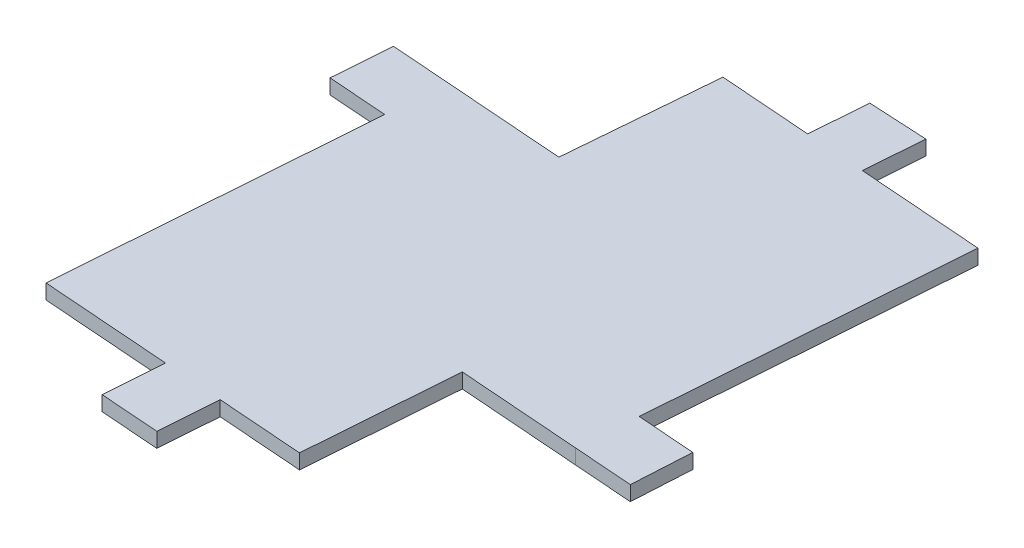
ISO-10303-21;
HEADER;
FILE_DESCRIPTION(('STEP AP214'),'2;1');
FILE_NAME('part.step','',(''),(''),'','','');
FILE_SCHEMA(('AUTOMOTIVE_DESIGN { 1 0 10303 214 1 1 1 1 }'));
ENDSEC;
DATA;
#1=APPLICATION_CONTEXT('core data for automotive mechanical design processes');
#2=APPLICATION_PROTOCOL_DEFINITION('international standard','automotive_design',2000,#1);
#3=PRODUCT_CONTEXT('',#1,'mechanical');
#4=PRODUCT('Part','Part','',(#3));
#5=PRODUCT_RELATED_PRODUCT_CATEGORY('part','',(#4));
#6=PRODUCT_DEFINITION_FORMATION('','',#4);
#7=PRODUCT_DEFINITION_CONTEXT('part definition',#1,'design');
#8=PRODUCT_DEFINITION('design','',#6,#7);
#9=PRODUCT_DEFINITION_SHAPE('','',#8);
#10=(LENGTH_UNIT() NAMED_UNIT(*) SI_UNIT(.MILLI.,.METRE.));
#11=(NAMED_UNIT(*) PLANE_ANGLE_UNIT() SI_UNIT($,.RADIAN.));
#12=(NAMED_UNIT(*) SI_UNIT($,.STERADIAN.) SOLID_ANGLE_UNIT());
#13=UNCERTAINTY_MEASURE_WITH_UNIT(LENGTH_MEASURE(1.E-05),#10,'distance_accuracy_value','');
#14=(GEOMETRIC_REPRESENTATION_CONTEXT(3) GLOBAL_UNCERTAINTY_ASSIGNED_CONTEXT((#13)) GLOBAL_UNIT_ASSIGNED_CONTEXT((#10,
#11,#12)) REPRESENTATION_CONTEXT('',''));
#15=CARTESIAN_POINT('',(0.,0.,0.));
#16=DIRECTION('',(0.,0.,1.));
#17=DIRECTION('',(1.,0.,0.));
#18=AXIS2_PLACEMENT_3D('',#15,#16,#17);
#19=CARTESIAN_POINT('',(12.5589915722332,2.,-43.116761017883));
#20=DIRECTION('',(-0.0532205729561729,0.,0.998582781052336));
#21=DIRECTION('',(0.998582781052336,0.,0.0532205729561729));
#22=AXIS2_PLACEMENT_3D('',#19,#20,#21);
#23=PLANE('',#22);
#24=DIRECTION('',(-0.998582781052336,0.,-0.0532205729561729));
#25=VECTOR('',#24,1.);
#26=CARTESIAN_POINT('',(12.5589915722332,0.,-43.116761017883));
#27=LINE('',#26,#25);
#28=CARTESIAN_POINT('',(12.5589915722332,0.,-43.116761017883));
#29=VERTEX_POINT('',#28);
#30=CARTESIAN_POINT('',(4.56852848401956,0.,-43.5426215792796));
#31=VERTEX_POINT('',#30);
#32=EDGE_CURVE('E212',#29,#31,#27,.T.);
#33=ORIENTED_EDGE('',*,*,#32,.T.);
#34=DIRECTION('',(0.,-1.,0.));
#35=VECTOR('',#34,1.);
#36=CARTESIAN_POINT('',(4.56852848401956,2.,-43.5426215792796));
#37=LINE('',#36,#35);
#38=CARTESIAN_POINT('',(4.56852848401956,2.,-43.5426215792796));
#39=VERTEX_POINT('',#38);
#40=EDGE_CURVE('E11',#39,#31,#37,.T.);
#41=ORIENTED_EDGE('',*,*,#40,.F.);
#42=DIRECTION('',(-0.998582781052336,0.,-0.0532205729561729));
#43=VECTOR('',#42,1.);
#44=CARTESIAN_POINT('',(12.5589915722332,2.,-43.116761017883));
#45=LINE('',#44,#43);
#46=CARTESIAN_POINT('',(12.5589915722332,2.,-43.116761017883));
#47=VERTEX_POINT('',#46);
#48=EDGE_CURVE('E254',#47,#39,#45,.T.);
#49=ORIENTED_EDGE('',*,*,#48,.F.);
#50=DIRECTION('',(0.,-1.,0.));
#51=VECTOR('',#50,1.);
#52=CARTESIAN_POINT('',(12.5589915722332,2.,-43.116761017883));
#53=LINE('',#52,#51);
#54=EDGE_CURVE('E208',#47,#29,#53,.T.);
#55=ORIENTED_EDGE('',*,*,#54,.T.);
#56=EDGE_LOOP('',(#33,#41,#49,#55));
#57=FACE_BOUND('',#56,.T.);
#58=ADVANCED_FACE('F32',(#57),#23,.F.);
#59=CARTESIAN_POINT('',(4.56852848401956,2.,-43.5426215792796));
#60=DIRECTION('',(0.997227874606259,0.,0.0744081051249303));
#61=DIRECTION('',(0.0744081051249303,0.,-0.997227874606259));
#62=AXIS2_PLACEMENT_3D('',#59,#60,#61);
#63=PLANE('',#62);
#64=DIRECTION('',(-0.0744081051249302,0.,0.997227874606259));
#65=VECTOR('',#64,1.);
#66=CARTESIAN_POINT('',(4.56852848401956,0.,-43.5426215792796));
#67=LINE('',#66,#65);
#68=CARTESIAN_POINT('',(3.98590373438367,0.,-35.7342028620324));
#69=VERTEX_POINT('',#68);
#70=EDGE_CURVE('E215',#31,#69,#67,.T.);
#71=ORIENTED_EDGE('',*,*,#70,.T.);
#72=DIRECTION('',(0.,-1.,0.));
#73=VECTOR('',#72,1.);
#74=CARTESIAN_POINT('',(3.98590373438367,2.,-35.7342028620324));
#75=LINE('',#74,#73);
#76=CARTESIAN_POINT('',(3.98590373438367,2.,-35.7342028620324));
#77=VERTEX_POINT('',#76);
#78=EDGE_CURVE('E40',#77,#69,#75,.T.);
#79=ORIENTED_EDGE('',*,*,#78,.F.);
#80=DIRECTION('',(-0.0744081051249302,0.,0.997227874606259));
#81=VECTOR('',#80,1.);
#82=CARTESIAN_POINT('',(4.56852848401956,2.,-43.5426215792796));
#83=LINE('',#82,#81);
#84=EDGE_CURVE('E133',#39,#77,#83,.T.);
#85=ORIENTED_EDGE('',*,*,#84,.F.);
#86=ORIENTED_EDGE('',*,*,#40,.T.);
#87=EDGE_LOOP('',(#71,#79,#85,#86));
#88=FACE_BOUND('',#87,.T.);
#89=ADVANCED_FACE('F382',(#88),#63,.F.);
#90=CARTESIAN_POINT('',(3.98590373438367,2.,-35.7342028620324));
#91=DIRECTION('',(-0.0744081051249308,0.,0.997227874606259));
#92=DIRECTION('',(0.997227874606259,0.,0.0744081051249308));
#93=AXIS2_PLACEMENT_3D('',#90,#91,#92);
#94=PLANE('',#93);
#95=DIRECTION('',(-0.997227874606259,0.,-0.0744081051249307));
#96=VECTOR('',#95,1.);
#97=CARTESIAN_POINT('',(3.98590373438367,0.,-35.7342028620324));
#98=LINE('',#97,#96);
#99=CARTESIAN_POINT('',(-8.38636228429482,0.,-36.6573588367036));
#100=VERTEX_POINT('',#99);
#101=EDGE_CURVE('E217',#69,#100,#98,.T.);
#102=ORIENTED_EDGE('',*,*,#101,.T.);
#103=DIRECTION('',(0.,-1.,0.));
#104=VECTOR('',#103,1.);
#105=CARTESIAN_POINT('',(-8.38636228429482,2.,-36.6573588367036));
#106=LINE('',#105,#104);
#107=CARTESIAN_POINT('',(-8.38636228429482,2.,-36.6573588367036));
#108=VERTEX_POINT('',#107);
#109=EDGE_CURVE('E303',#108,#100,#106,.T.);
#110=ORIENTED_EDGE('',*,*,#109,.F.);
#111=DIRECTION('',(-0.997227874606259,0.,-0.0744081051249307));
#112=VECTOR('',#111,1.);
#113=CARTESIAN_POINT('',(3.98590373438367,2.,-35.7342028620324));
#114=LINE('',#113,#112);
#115=EDGE_CURVE('E311',#77,#108,#114,.T.);
#116=ORIENTED_EDGE('',*,*,#115,.F.);
#117=ORIENTED_EDGE('',*,*,#78,.T.);
#118=EDGE_LOOP('',(#102,#110,#116,#117));
#119=FACE_BOUND('',#118,.T.);
#120=ADVANCED_FACE('F309',(#119),#94,.F.);
#121=CARTESIAN_POINT('',(-8.38636228429482,2.,-36.6573588367036));
#122=DIRECTION('',(0.996482273874882,0.,0.0838038057199363));
#123=DIRECTION('',(0.0838038057199363,0.,-0.996482273874882));
#124=AXIS2_PLACEMENT_3D('',#121,#122,#123);
#125=PLANE('',#124);
#126=DIRECTION('',(-0.0838038057199363,0.,0.996482273874882));
#127=VECTOR('',#126,1.);
#128=CARTESIAN_POINT('',(-8.38636228429482,0.,-36.6573588367036));
#129=LINE('',#128,#127);
#130=CARTESIAN_POINT('',(-10.1054600578189,0.,-16.2161575850634));
#131=VERTEX_POINT('',#130);
#132=EDGE_CURVE('E219',#100,#131,#129,.T.);
#133=ORIENTED_EDGE('',*,*,#132,.T.);
#134=DIRECTION('',(0.,-1.,0.));
#135=VECTOR('',#134,1.);
#136=CARTESIAN_POINT('',(-10.1054600578189,2.,-16.2161575850634));
#137=LINE('',#136,#135);
#138=CARTESIAN_POINT('',(-10.1054600578189,2.,-16.2161575850634));
#139=VERTEX_POINT('',#138);
#140=EDGE_CURVE('E300',#139,#131,#137,.T.);
#141=ORIENTED_EDGE('',*,*,#140,.F.);
#142=DIRECTION('',(-0.0838038057199363,0.,0.996482273874882));
#143=VECTOR('',#142,1.);
#144=CARTESIAN_POINT('',(-8.38636228429482,2.,-36.6573588367036));
#145=LINE('',#144,#143);
#146=EDGE_CURVE('E329',#108,#139,#145,.T.);
#147=ORIENTED_EDGE('',*,*,#146,.F.);
#148=ORIENTED_EDGE('',*,*,#109,.T.);
#149=EDGE_LOOP('',(#133,#141,#147,#148));
#150=FACE_BOUND('',#149,.T.);
#151=ADVANCED_FACE('F320',(#150),#125,.F.);
#152=CARTESIAN_POINT('',(-10.1054600578189,2.,-16.2161575850634));
#153=DIRECTION('',(-0.0744050572221805,0.,0.997228102020678));
#154=DIRECTION('',(0.997228102020678,0.,0.0744050572221805));
#155=AXIS2_PLACEMENT_3D('',#152,#153,#154);
#156=PLANE('',#155);
#157=DIRECTION('',(-0.997228102020678,0.,-0.0744050572221805));
#158=VECTOR('',#157,1.);
#159=CARTESIAN_POINT('',(-10.1054600578189,0.,-16.2161575850634));
#160=LINE('',#159,#158);
#161=CARTESIAN_POINT('',(-26.2606586019027,0.,-17.4215272188238));
#162=VERTEX_POINT('',#161);
#163=EDGE_CURVE('E221',#131,#162,#160,.T.);
#164=ORIENTED_EDGE('',*,*,#163,.T.);
#165=DIRECTION('',(0.,-1.,0.));
#166=VECTOR('',#165,1.);
#167=CARTESIAN_POINT('',(-26.2606586019027,2.,-17.4215272188238));
#168=LINE('',#167,#166);
#169=CARTESIAN_POINT('',(-26.2606586019027,2.,-17.4215272188238));
#170=VERTEX_POINT('',#169);
#171=EDGE_CURVE('E297',#170,#162,#168,.T.);
#172=ORIENTED_EDGE('',*,*,#171,.F.);
#173=DIRECTION('',(-0.997228102020678,0.,-0.0744050572221805));
#174=VECTOR('',#173,1.);
#175=CARTESIAN_POINT('',(-10.1054600578189,2.,-16.2161575850634));
#176=LINE('',#175,#174);
#177=EDGE_CURVE('E326',#139,#170,#176,.T.);
#178=ORIENTED_EDGE('',*,*,#177,.F.);
#179=ORIENTED_EDGE('',*,*,#140,.T.);
#180=EDGE_LOOP('',(#164,#172,#178,#179));
#181=FACE_BOUND('',#180,.T.);
#182=ADVANCED_FACE('F324',(#181),#156,.F.);
#183=CARTESIAN_POINT('',(-26.2606586019027,2.,-17.4215272188238));
#184=DIRECTION('',(-0.0744081051249254,0.,0.99722787460626));
#185=DIRECTION('',(0.99722787460626,0.,0.0744081051249254));
#186=AXIS2_PLACEMENT_3D('',#183,#184,#185);
#187=PLANE('',#186);
#188=DIRECTION('',(-0.99722787460626,0.,-0.0744081051249254));
#189=VECTOR('',#188,1.);
#190=CARTESIAN_POINT('',(-26.2606586019027,0.,-17.4215272188238));
#191=LINE('',#190,#189);
#192=CARTESIAN_POINT('',(-34.2384815987528,0.,-18.0167920598232));
#193=VERTEX_POINT('',#192);
#194=EDGE_CURVE('E223',#162,#193,#191,.T.);
#195=ORIENTED_EDGE('',*,*,#194,.T.);
#196=DIRECTION('',(0.,-1.,0.));
#197=VECTOR('',#196,1.);
#198=CARTESIAN_POINT('',(-34.2384815987528,2.,-18.0167920598232));
#199=LINE('',#198,#197);
#200=CARTESIAN_POINT('',(-34.2384815987528,2.,-18.0167920598232));
#201=VERTEX_POINT('',#200);
#202=EDGE_CURVE('E294',#201,#193,#199,.T.);
#203=ORIENTED_EDGE('',*,*,#202,.F.);
#204=DIRECTION('',(-0.99722787460626,0.,-0.0744081051249254));
#205=VECTOR('',#204,1.);
#206=CARTESIAN_POINT('',(-26.2606586019027,2.,-17.4215272188238));
#207=LINE('',#206,#205);
#208=EDGE_CURVE('E328',#170,#201,#207,.T.);
#209=ORIENTED_EDGE('',*,*,#208,.F.);
#210=ORIENTED_EDGE('',*,*,#171,.T.);
#211=EDGE_LOOP('',(#195,#203,#209,#210));
#212=FACE_BOUND('',#211,.T.);
#213=ADVANCED_FACE('F395',(#212),#187,.F.);
#214=CARTESIAN_POINT('',(-34.2384815987528,2.,-18.0167920598232));
#215=DIRECTION('',(0.997228030211571,0.,0.0744060196513019));
#216=DIRECTION('',(0.0744060196513019,0.,-0.997228030211571));
#217=AXIS2_PLACEMENT_3D('',#214,#215,#216);
#218=PLANE('',#217);
#219=DIRECTION('',(-0.0744060196513019,0.,0.997228030211571));
#220=VECTOR('',#219,1.);
#221=CARTESIAN_POINT('',(-34.2384815987528,0.,-18.0167920598232));
#222=LINE('',#221,#220);
#223=CARTESIAN_POINT('',(-34.8337297290203,0.,-10.038968179233));
#224=VERTEX_POINT('',#223);
#225=EDGE_CURVE('E225',#193,#224,#222,.T.);
#226=ORIENTED_EDGE('',*,*,#225,.T.);
#227=DIRECTION('',(0.,-1.,0.));
#228=VECTOR('',#227,1.);
#229=CARTESIAN_POINT('',(-34.8337297290203,2.,-10.038968179233));
#230=LINE('',#229,#228);
#231=CARTESIAN_POINT('',(-34.8337297290203,2.,-10.038968179233));
#232=VERTEX_POINT('',#231);
#233=EDGE_CURVE('E291',#232,#224,#230,.T.);
#234=ORIENTED_EDGE('',*,*,#233,.F.);
#235=DIRECTION('',(-0.0744060196513019,0.,0.997228030211571));
#236=VECTOR('',#235,1.);
#237=CARTESIAN_POINT('',(-34.2384815987528,2.,-18.0167920598232));
#238=LINE('',#237,#236);
#239=EDGE_CURVE('E331',#201,#232,#238,.T.);
#240=ORIENTED_EDGE('',*,*,#239,.F.);
#241=ORIENTED_EDGE('',*,*,#202,.T.);
#242=EDGE_LOOP('',(#226,#234,#240,#241));
#243=FACE_BOUND('',#242,.T.);
#244=ADVANCED_FACE('F398',(#243),#218,.F.);
#245=CARTESIAN_POINT('',(-34.8337297290203,2.,-10.038968179233));
#246=DIRECTION('',(0.0744081051249255,0.,-0.99722787460626));
#247=DIRECTION('',(-0.99722787460626,0.,-0.0744081051249255));
#248=AXIS2_PLACEMENT_3D('',#245,#246,#247);
#249=PLANE('',#248);
#250=DIRECTION('',(0.99722787460626,0.,0.0744081051249255));
#251=VECTOR('',#250,1.);
#252=CARTESIAN_POINT('',(-34.8337297290203,0.,-10.038968179233));
#253=LINE('',#252,#251);
#254=CARTESIAN_POINT('',(-26.8559067321695,0.,-9.44370333823355));
#255=VERTEX_POINT('',#254);
#256=EDGE_CURVE('E227',#224,#255,#253,.T.);
#257=ORIENTED_EDGE('',*,*,#256,.T.);
#258=DIRECTION('',(0.,-1.,0.));
#259=VECTOR('',#258,1.);
#260=CARTESIAN_POINT('',(-26.8559067321695,2.,-9.44370333823355));
#261=LINE('',#260,#259);
#262=CARTESIAN_POINT('',(-26.8559067321695,2.,-9.44370333823355));
#263=VERTEX_POINT('',#262);
#264=EDGE_CURVE('E288',#263,#255,#261,.T.);
#265=ORIENTED_EDGE('',*,*,#264,.F.);
#266=DIRECTION('',(0.99722787460626,0.,0.0744081051249255));
#267=VECTOR('',#266,1.);
#268=CARTESIAN_POINT('',(-34.8337297290203,2.,-10.038968179233));
#269=LINE('',#268,#267);
#270=EDGE_CURVE('E337',#232,#263,#269,.T.);
#271=ORIENTED_EDGE('',*,*,#270,.F.);
#272=ORIENTED_EDGE('',*,*,#233,.T.);
#273=EDGE_LOOP('',(#257,#265,#271,#272));
#274=FACE_BOUND('',#273,.T.);
#275=ADVANCED_FACE('F402',(#274),#249,.F.);
#276=CARTESIAN_POINT('',(-26.8559067321695,2.,-9.44370333823355));
#277=DIRECTION('',(0.99722787460626,0.,0.0744081051249255));
#278=DIRECTION('',(0.0744081051249255,0.,-0.99722787460626));
#279=AXIS2_PLACEMENT_3D('',#276,#277,#278);
#280=PLANE('',#279);
#281=DIRECTION('',(-0.0744081051249255,0.,0.99722787460626));
#282=VECTOR('',#281,1.);
#283=CARTESIAN_POINT('',(-26.8559067321695,0.,-9.44370333823355));
#284=LINE('',#283,#282);
#285=CARTESIAN_POINT('',(-30.0322027196897,0.,33.1254615590212));
#286=VERTEX_POINT('',#285);
#287=EDGE_CURVE('E229',#255,#286,#284,.T.);
#288=ORIENTED_EDGE('',*,*,#287,.T.);
#289=DIRECTION('',(0.,-1.,0.));
#290=VECTOR('',#289,1.);
#291=CARTESIAN_POINT('',(-30.0322027196897,2.,33.1254615590212));
#292=LINE('',#291,#290);
#293=CARTESIAN_POINT('',(-30.0322027196897,2.,33.1254615590212));
#294=VERTEX_POINT('',#293);
#295=EDGE_CURVE('E285',#294,#286,#292,.T.);
#296=ORIENTED_EDGE('',*,*,#295,.F.);
#297=DIRECTION('',(-0.0744081051249255,0.,0.99722787460626));
#298=VECTOR('',#297,1.);
#299=CARTESIAN_POINT('',(-26.8559067321695,2.,-9.44370333823355));
#300=LINE('',#299,#298);
#301=EDGE_CURVE('E339',#263,#294,#300,.T.);
#302=ORIENTED_EDGE('',*,*,#301,.F.);
#303=ORIENTED_EDGE('',*,*,#264,.T.);
#304=EDGE_LOOP('',(#288,#296,#302,#303));
#305=FACE_BOUND('',#304,.T.);
#306=ADVANCED_FACE('F406',(#305),#280,.F.);
#307=CARTESIAN_POINT('',(-30.0322027196897,2.,33.1254615590212));
#308=DIRECTION('',(0.0744081051249242,0.,-0.99722787460626));
#309=DIRECTION('',(-0.99722787460626,0.,-0.0744081051249242));
#310=AXIS2_PLACEMENT_3D('',#307,#308,#309);
#311=PLANE('',#310);
#312=DIRECTION('',(0.99722787460626,0.,0.0744081051249242));
#313=VECTOR('',#312,1.);
#314=CARTESIAN_POINT('',(-30.0322027196897,0.,33.1254615590212));
#315=LINE('',#314,#313);
#316=CARTESIAN_POINT('',(-12.5806279455125,0.,34.4276098878625));
#317=VERTEX_POINT('',#316);
#318=EDGE_CURVE('E231',#286,#317,#315,.T.);
#319=ORIENTED_EDGE('',*,*,#318,.T.);
#320=DIRECTION('',(0.,-1.,0.));
#321=VECTOR('',#320,1.);
#322=CARTESIAN_POINT('',(-12.5806279455125,2.,34.4276098878625));
#323=LINE('',#322,#321);
#324=CARTESIAN_POINT('',(-12.5806279455125,2.,34.4276098878625));
#325=VERTEX_POINT('',#324);
#326=EDGE_CURVE('E282',#325,#317,#323,.T.);
#327=ORIENTED_EDGE('',*,*,#326,.F.);
#328=DIRECTION('',(0.99722787460626,0.,0.0744081051249242));
#329=VECTOR('',#328,1.);
#330=CARTESIAN_POINT('',(-30.0322027196897,2.,33.1254615590212));
#331=LINE('',#330,#329);
#332=EDGE_CURVE('E341',#294,#325,#331,.T.);
#333=ORIENTED_EDGE('',*,*,#332,.F.);
#334=ORIENTED_EDGE('',*,*,#295,.T.);
#335=EDGE_LOOP('',(#319,#327,#333,#334));
#336=FACE_BOUND('',#335,.T.);
#337=ADVANCED_FACE('F410',(#336),#311,.F.);
#338=CARTESIAN_POINT('',(-12.5806279455125,2.,34.4276098878625));
#339=DIRECTION('',(0.99722787460626,0.,0.0744081051249256));
#340=DIRECTION('',(0.0744081051249256,0.,-0.99722787460626));
#341=AXIS2_PLACEMENT_3D('',#338,#339,#340);
#342=PLANE('',#341);
#343=DIRECTION('',(-0.0744081051249256,0.,0.99722787460626));
#344=VECTOR('',#343,1.);
#345=CARTESIAN_POINT('',(-12.5806279455125,0.,34.4276098878625));
#346=LINE('',#345,#344);
#347=CARTESIAN_POINT('',(-13.1758927865119,0.,42.4054328847126));
#348=VERTEX_POINT('',#347);
#349=EDGE_CURVE('E233',#317,#348,#346,.T.);
#350=ORIENTED_EDGE('',*,*,#349,.T.);
#351=DIRECTION('',(0.,-1.,0.));
#352=VECTOR('',#351,1.);
#353=CARTESIAN_POINT('',(-13.1758927865119,2.,42.4054328847126));
#354=LINE('',#353,#352);
#355=CARTESIAN_POINT('',(-13.1758927865119,2.,42.4054328847126));
#356=VERTEX_POINT('',#355);
#357=EDGE_CURVE('E279',#356,#348,#354,.T.);
#358=ORIENTED_EDGE('',*,*,#357,.F.);
#359=DIRECTION('',(-0.0744081051249256,0.,0.99722787460626));
#360=VECTOR('',#359,1.);
#361=CARTESIAN_POINT('',(-12.5806279455125,2.,34.4276098878625));
#362=LINE('',#361,#360);
#363=EDGE_CURVE('E343',#325,#356,#362,.T.);
#364=ORIENTED_EDGE('',*,*,#363,.F.);
#365=ORIENTED_EDGE('',*,*,#326,.T.);
#366=EDGE_LOOP('',(#350,#358,#364,#365));
#367=FACE_BOUND('',#366,.T.);
#368=ADVANCED_FACE('F414',(#367),#342,.F.);
#369=CARTESIAN_POINT('',(-13.1758927865119,2.,42.4054328847126));
#370=DIRECTION('',(0.0744081051249242,0.,-0.99722787460626));
#371=DIRECTION('',(-0.99722787460626,0.,-0.0744081051249242));
#372=AXIS2_PLACEMENT_3D('',#369,#370,#371);
#373=PLANE('',#372);
#374=DIRECTION('',(0.99722787460626,0.,0.0744081051249242));
#375=VECTOR('',#374,1.);
#376=CARTESIAN_POINT('',(-13.1758927865119,0.,42.4054328847126));
#377=LINE('',#376,#375);
#378=CARTESIAN_POINT('',(-5.19806978966187,0.,43.000697725712));
#379=VERTEX_POINT('',#378);
#380=EDGE_CURVE('E235',#348,#379,#377,.T.);
#381=ORIENTED_EDGE('',*,*,#380,.T.);
#382=DIRECTION('',(0.,-1.,0.));
#383=VECTOR('',#382,1.);
#384=CARTESIAN_POINT('',(-5.19806978966187,2.,43.000697725712));
#385=LINE('',#384,#383);
#386=CARTESIAN_POINT('',(-5.19806978966187,2.,43.000697725712));
#387=VERTEX_POINT('',#386);
#388=EDGE_CURVE('E276',#387,#379,#385,.T.);
#389=ORIENTED_EDGE('',*,*,#388,.F.);
#390=DIRECTION('',(0.99722787460626,0.,0.0744081051249242));
#391=VECTOR('',#390,1.);
#392=CARTESIAN_POINT('',(-13.1758927865119,2.,42.4054328847126));
#393=LINE('',#392,#391);
#394=EDGE_CURVE('E345',#356,#387,#393,.T.);
#395=ORIENTED_EDGE('',*,*,#394,.F.);
#396=ORIENTED_EDGE('',*,*,#357,.T.);
#397=EDGE_LOOP('',(#381,#389,#395,#396));
#398=FACE_BOUND('',#397,.T.);
#399=ADVANCED_FACE('F418',(#398),#373,.F.);
#400=CARTESIAN_POINT('',(-5.19806978966187,2.,43.000697725712));
#401=DIRECTION('',(-0.99722787460626,0.,-0.0744081051249251));
#402=DIRECTION('',(-0.0744081051249251,0.,0.99722787460626));
#403=AXIS2_PLACEMENT_3D('',#400,#401,#402);
#404=PLANE('',#403);
#405=DIRECTION('',(0.0744081051249251,0.,-0.99722787460626));
#406=VECTOR('',#405,1.);
#407=CARTESIAN_POINT('',(-5.19806978966187,0.,43.000697725712));
#408=LINE('',#407,#406);
#409=CARTESIAN_POINT('',(-4.60280494866247,0.,35.0228747288619));
#410=VERTEX_POINT('',#409);
#411=EDGE_CURVE('E237',#379,#410,#408,.T.);
#412=ORIENTED_EDGE('',*,*,#411,.T.);
#413=DIRECTION('',(0.,-1.,0.));
#414=VECTOR('',#413,1.);
#415=CARTESIAN_POINT('',(-4.60280494866247,2.,35.0228747288619));
#416=LINE('',#415,#414);
#417=CARTESIAN_POINT('',(-4.60280494866247,2.,35.0228747288619));
#418=VERTEX_POINT('',#417);
#419=EDGE_CURVE('E273',#418,#410,#416,.T.);
#420=ORIENTED_EDGE('',*,*,#419,.F.);
#421=DIRECTION('',(0.0744081051249251,0.,-0.99722787460626));
#422=VECTOR('',#421,1.);
#423=CARTESIAN_POINT('',(-5.19806978966187,2.,43.000697725712));
#424=LINE('',#423,#422);
#425=EDGE_CURVE('E347',#387,#418,#424,.T.);
#426=ORIENTED_EDGE('',*,*,#425,.F.);
#427=ORIENTED_EDGE('',*,*,#388,.T.);
#428=EDGE_LOOP('',(#412,#420,#426,#427));
#429=FACE_BOUND('',#428,.T.);
#430=ADVANCED_FACE('F422',(#429),#404,.F.);
#431=CARTESIAN_POINT('',(-4.60280494866247,2.,35.0228747288619));
#432=DIRECTION('',(0.0744081051249248,0.,-0.99722787460626));
#433=DIRECTION('',(-0.99722787460626,0.,-0.0744081051249248));
#434=AXIS2_PLACEMENT_3D('',#431,#432,#433);
#435=PLANE('',#434);
#436=DIRECTION('',(0.99722787460626,0.,0.0744081051249248));
#437=VECTOR('',#436,1.);
#438=CARTESIAN_POINT('',(-4.60280494866247,0.,35.0228747288619));
#439=LINE('',#438,#437);
#440=CARTESIAN_POINT('',(6.96503839677019,0.,35.886008748311));
#441=VERTEX_POINT('',#440);
#442=EDGE_CURVE('E239',#410,#441,#439,.T.);
#443=ORIENTED_EDGE('',*,*,#442,.T.);
#444=DIRECTION('',(0.,-1.,0.));
#445=VECTOR('',#444,1.);
#446=CARTESIAN_POINT('',(6.96503839677019,2.,35.886008748311));
#447=LINE('',#446,#445);
#448=CARTESIAN_POINT('',(6.96503839677019,2.,35.886008748311));
#449=VERTEX_POINT('',#448);
#450=EDGE_CURVE('E270',#449,#441,#447,.T.);
#451=ORIENTED_EDGE('',*,*,#450,.F.);
#452=DIRECTION('',(0.99722787460626,0.,0.0744081051249248));
#453=VECTOR('',#452,1.);
#454=CARTESIAN_POINT('',(-4.60280494866247,2.,35.0228747288619));
#455=LINE('',#454,#453);
#456=EDGE_CURVE('E349',#418,#449,#455,.T.);
#457=ORIENTED_EDGE('',*,*,#456,.F.);
#458=ORIENTED_EDGE('',*,*,#419,.T.);
#459=EDGE_LOOP('',(#443,#451,#457,#458));
#460=FACE_BOUND('',#459,.T.);
#461=ADVANCED_FACE('F426',(#460),#435,.F.);
#462=CARTESIAN_POINT('',(6.96503839677019,2.,35.886008748311));
#463=DIRECTION('',(-0.997227874606257,0.,-0.0744081051249591));
#464=DIRECTION('',(-0.0744081051249591,0.,0.997227874606257));
#465=AXIS2_PLACEMENT_3D('',#462,#463,#464);
#466=PLANE('',#465);
#467=DIRECTION('',(0.0744081051249591,0.,-0.997227874606257));
#468=VECTOR('',#467,1.);
#469=CARTESIAN_POINT('',(6.96503839677019,0.,35.886008748311));
#470=LINE('',#469,#468);
#471=CARTESIAN_POINT('',(8.4919149305371,0.,15.4225950113605));
#472=VERTEX_POINT('',#471);
#473=EDGE_CURVE('E241',#441,#472,#470,.T.);
#474=ORIENTED_EDGE('',*,*,#473,.T.);
#475=DIRECTION('',(0.,-1.,0.));
#476=VECTOR('',#475,1.);
#477=CARTESIAN_POINT('',(8.4919149305371,2.,15.4225950113605));
#478=LINE('',#477,#476);
#479=CARTESIAN_POINT('',(8.4919149305371,2.,15.4225950113605));
#480=VERTEX_POINT('',#479);
#481=EDGE_CURVE('E267',#480,#472,#478,.T.);
#482=ORIENTED_EDGE('',*,*,#481,.F.);
#483=DIRECTION('',(0.0744081051249591,0.,-0.997227874606257));
#484=VECTOR('',#483,1.);
#485=CARTESIAN_POINT('',(6.96503839677019,2.,35.886008748311));
#486=LINE('',#485,#484);
#487=EDGE_CURVE('E351',#449,#480,#486,.T.);
#488=ORIENTED_EDGE('',*,*,#487,.F.);
#489=ORIENTED_EDGE('',*,*,#450,.T.);
#490=EDGE_LOOP('',(#474,#482,#488,#489));
#491=FACE_BOUND('',#490,.T.);
#492=ADVANCED_FACE('F430',(#491),#466,.F.);
#493=CARTESIAN_POINT('',(8.4919149305371,2.,15.4225950113605));
#494=DIRECTION('',(0.0748774149537591,0.,-0.997192746027488));
#495=DIRECTION('',(-0.997192746027488,0.,-0.0748774149537591));
#496=AXIS2_PLACEMENT_3D('',#493,#494,#495);
#497=PLANE('',#496);
#498=DIRECTION('',(0.997192746027488,0.,0.0748774149537591));
#499=VECTOR('',#498,1.);
#500=CARTESIAN_POINT('',(8.4919149305371,0.,15.4225950113605));
#501=LINE('',#500,#499);
#502=CARTESIAN_POINT('',(25.0508192924834,0.,16.6659734434925));
#503=VERTEX_POINT('',#502);
#504=EDGE_CURVE('E243',#472,#503,#501,.T.);
#505=ORIENTED_EDGE('',*,*,#504,.T.);
#506=DIRECTION('',(0.,-1.,0.));
#507=VECTOR('',#506,1.);
#508=CARTESIAN_POINT('',(25.0508192924834,2.,16.6659734434925));
#509=LINE('',#508,#507);
#510=CARTESIAN_POINT('',(25.0508192924834,2.,16.6659734434925));
#511=VERTEX_POINT('',#510);
#512=EDGE_CURVE('E264',#511,#503,#509,.T.);
#513=ORIENTED_EDGE('',*,*,#512,.F.);
#514=DIRECTION('',(0.997192746027488,0.,0.0748774149537591));
#515=VECTOR('',#514,1.);
#516=CARTESIAN_POINT('',(8.4919149305371,2.,15.4225950113605));
#517=LINE('',#516,#515);
#518=EDGE_CURVE('E353',#480,#511,#517,.T.);
#519=ORIENTED_EDGE('',*,*,#518,.F.);
#520=ORIENTED_EDGE('',*,*,#481,.T.);
#521=EDGE_LOOP('',(#505,#513,#519,#520));
#522=FACE_BOUND('',#521,.T.);
#523=ADVANCED_FACE('F434',(#522),#497,.F.);
#524=CARTESIAN_POINT('',(25.0508192924834,2.,16.6659734434925));
#525=DIRECTION('',(0.0744060196513018,0.,-0.997228030211571));
#526=DIRECTION('',(-0.997228030211571,0.,-0.0744060196513018));
#527=AXIS2_PLACEMENT_3D('',#524,#525,#526);
#528=PLANE('',#527);
#529=DIRECTION('',(0.997228030211571,0.,0.0744060196513018));
#530=VECTOR('',#529,1.);
#531=CARTESIAN_POINT('',(25.0508192924834,0.,16.6659734434925));
#532=LINE('',#531,#530);
#533=CARTESIAN_POINT('',(33.0232436866314,0.,17.2608187027194));
#534=VERTEX_POINT('',#533);
#535=EDGE_CURVE('E245',#503,#534,#532,.T.);
#536=ORIENTED_EDGE('',*,*,#535,.T.);
#537=DIRECTION('',(0.,-1.,0.));
#538=VECTOR('',#537,1.);
#539=CARTESIAN_POINT('',(33.0232436866314,2.,17.2608187027194));
#540=LINE('',#539,#538);
#541=CARTESIAN_POINT('',(33.0232436866314,2.,17.2608187027194));
#542=VERTEX_POINT('',#541);
#543=EDGE_CURVE('E261',#542,#534,#540,.T.);
#544=ORIENTED_EDGE('',*,*,#543,.F.);
#545=DIRECTION('',(0.997228030211571,0.,0.0744060196513018));
#546=VECTOR('',#545,1.);
#547=CARTESIAN_POINT('',(25.0508192924834,2.,16.6659734434925));
#548=LINE('',#547,#546);
#549=EDGE_CURVE('E355',#511,#542,#548,.T.);
#550=ORIENTED_EDGE('',*,*,#549,.F.);
#551=ORIENTED_EDGE('',*,*,#512,.T.);
#552=EDGE_LOOP('',(#536,#544,#550,#551));
#553=FACE_BOUND('',#552,.T.);
#554=ADVANCED_FACE('F438',(#553),#528,.F.);
#555=CARTESIAN_POINT('',(33.0232436866314,2.,17.2608187027194));
#556=DIRECTION('',(-0.998376825904802,0.,-0.0569536082812384));
#557=DIRECTION('',(-0.0569536082812384,0.,0.998376825904802));
#558=AXIS2_PLACEMENT_3D('',#555,#556,#557);
#559=PLANE('',#558);
#560=DIRECTION('',(0.0569536082812384,0.,-0.998376825904802));
#561=VECTOR('',#560,1.);
#562=CARTESIAN_POINT('',(33.0232436866314,0.,17.2608187027194));
#563=LINE('',#562,#561);
#564=CARTESIAN_POINT('',(33.4789120712009,0.,9.27311135316456));
#565=VERTEX_POINT('',#564);
#566=EDGE_CURVE('E247',#534,#565,#563,.T.);
#567=ORIENTED_EDGE('',*,*,#566,.T.);
#568=DIRECTION('',(0.,-1.,0.));
#569=VECTOR('',#568,1.);
#570=CARTESIAN_POINT('',(33.4789120712009,2.,9.27311135316456));
#571=LINE('',#570,#569);
#572=CARTESIAN_POINT('',(33.4789120712009,2.,9.27311135316456));
#573=VERTEX_POINT('',#572);
#574=EDGE_CURVE('E258',#573,#565,#571,.T.);
#575=ORIENTED_EDGE('',*,*,#574,.F.);
#576=DIRECTION('',(0.0569536082812384,0.,-0.998376825904802));
#577=VECTOR('',#576,1.);
#578=CARTESIAN_POINT('',(33.0232436866314,2.,17.2608187027194));
#579=LINE('',#578,#577);
#580=EDGE_CURVE('E357',#542,#573,#579,.T.);
#581=ORIENTED_EDGE('',*,*,#580,.F.);
#582=ORIENTED_EDGE('',*,*,#543,.T.);
#583=EDGE_LOOP('',(#567,#575,#581,#582));
#584=FACE_BOUND('',#583,.T.);
#585=ADVANCED_FACE('F363',(#584),#559,.F.);
#586=CARTESIAN_POINT('',(33.4789120712009,2.,9.27311135316456));
#587=DIRECTION('',(-0.0744753677703029,0.,0.997222853526471));
#588=DIRECTION('',(0.997222853526472,0.,0.0744753677703029));
#589=AXIS2_PLACEMENT_3D('',#586,#587,#588);
#590=PLANE('',#589);
#591=DIRECTION('',(-0.997222853526471,0.,-0.0744753677703029));
#592=VECTOR('',#591,1.);
#593=CARTESIAN_POINT('',(33.4789120712009,0.,9.27311135316456));
#594=LINE('',#593,#592);
#595=CARTESIAN_POINT('',(25.6460849894747,0.,8.68813410807853));
#596=VERTEX_POINT('',#595);
#597=EDGE_CURVE('E249',#565,#596,#594,.T.);
#598=ORIENTED_EDGE('',*,*,#597,.T.);
#599=DIRECTION('',(0.,-1.,0.));
#600=VECTOR('',#599,1.);
#601=CARTESIAN_POINT('',(25.6460849894747,2.,8.68813410807853));
#602=LINE('',#601,#600);
#603=CARTESIAN_POINT('',(25.6460849894747,2.,8.68813410807853));
#604=VERTEX_POINT('',#603);
#605=EDGE_CURVE('E203',#604,#596,#602,.T.);
#606=ORIENTED_EDGE('',*,*,#605,.F.);
#607=DIRECTION('',(-0.997222853526471,0.,-0.0744753677703029));
#608=VECTOR('',#607,1.);
#609=CARTESIAN_POINT('',(33.4789120712009,2.,9.27311135316456));
#610=LINE('',#609,#608);
#611=EDGE_CURVE('E194',#573,#604,#610,.T.);
#612=ORIENTED_EDGE('',*,*,#611,.F.);
#613=ORIENTED_EDGE('',*,*,#574,.T.);
#614=EDGE_LOOP('',(#598,#606,#612,#613));
#615=FACE_BOUND('',#614,.T.);
#616=ADVANCED_FACE('F367',(#615),#590,.F.);
#617=CARTESIAN_POINT('',(25.6460849894747,2.,8.68813410807853));
#618=DIRECTION('',(-0.997192746027488,0.,-0.0748774149537589));
#619=DIRECTION('',(-0.0748774149537589,0.,0.997192746027488));
#620=AXIS2_PLACEMENT_3D('',#617,#618,#619);
#621=PLANE('',#620);
#622=DIRECTION('',(0.0748774149537589,0.,-0.997192746027488));
#623=VECTOR('',#622,1.);
#624=CARTESIAN_POINT('',(25.6460849894747,0.,8.68813410807853));
#625=LINE('',#624,#623);
#626=CARTESIAN_POINT('',(28.842414994284,0.,-33.8795359520357));
#627=VERTEX_POINT('',#626);
#628=EDGE_CURVE('E202',#596,#627,#625,.T.);
#629=ORIENTED_EDGE('',*,*,#628,.T.);
#630=DIRECTION('',(0.,-1.,0.));
#631=VECTOR('',#630,1.);
#632=CARTESIAN_POINT('',(28.842414994284,2.,-33.8795359520357));
#633=LINE('',#632,#631);
#634=CARTESIAN_POINT('',(28.842414994284,2.,-33.8795359520357));
#635=VERTEX_POINT('',#634);
#636=EDGE_CURVE('E199',#635,#627,#633,.T.);
#637=ORIENTED_EDGE('',*,*,#636,.F.);
#638=DIRECTION('',(0.0748774149537589,0.,-0.997192746027488));
#639=VECTOR('',#638,1.);
#640=CARTESIAN_POINT('',(25.6460849894747,2.,8.68813410807853));
#641=LINE('',#640,#639);
#642=EDGE_CURVE('E188',#604,#635,#641,.T.);
#643=ORIENTED_EDGE('',*,*,#642,.F.);
#644=ORIENTED_EDGE('',*,*,#605,.T.);
#645=EDGE_LOOP('',(#629,#637,#643,#644));
#646=FACE_BOUND('',#645,.T.);
#647=ADVANCED_FACE('F200',(#646),#621,.F.);
#648=CARTESIAN_POINT('',(28.842414994284,2.,-33.8795359520357));
#649=DIRECTION('',(-0.0744081051249245,0.,0.99722787460626));
#650=DIRECTION('',(0.99722787460626,0.,0.0744081051249245));
#651=AXIS2_PLACEMENT_3D('',#648,#649,#650);
#652=PLANE('',#651);
#653=DIRECTION('',(-0.99722787460626,0.,-0.0744081051249245));
#654=VECTOR('',#653,1.);
#655=CARTESIAN_POINT('',(28.842414994284,0.,-33.8795359520357));
#656=LINE('',#655,#654);
#657=CARTESIAN_POINT('',(11.9637267581775,0.,-35.1389383821362));
#658=VERTEX_POINT('',#657);
#659=EDGE_CURVE('E119',#627,#658,#656,.T.);
#660=ORIENTED_EDGE('',*,*,#659,.T.);
#661=DIRECTION('',(0.,-1.,0.));
#662=VECTOR('',#661,1.);
#663=CARTESIAN_POINT('',(11.9637267581775,2.,-35.1389383821362));
#664=LINE('',#663,#662);
#665=CARTESIAN_POINT('',(11.9637267581775,2.,-35.1389383821362));
#666=VERTEX_POINT('',#665);
#667=EDGE_CURVE('E204',#666,#658,#664,.T.);
#668=ORIENTED_EDGE('',*,*,#667,.F.);
#669=DIRECTION('',(-0.99722787460626,0.,-0.0744081051249245));
#670=VECTOR('',#669,1.);
#671=CARTESIAN_POINT('',(28.842414994284,2.,-33.8795359520357));
#672=LINE('',#671,#670);
#673=EDGE_CURVE('E192',#635,#666,#672,.T.);
#674=ORIENTED_EDGE('',*,*,#673,.F.);
#675=ORIENTED_EDGE('',*,*,#636,.T.);
#676=EDGE_LOOP('',(#660,#668,#674,#675));
#677=FACE_BOUND('',#676,.T.);
#678=ADVANCED_FACE('F206',(#677),#652,.F.);
#679=CARTESIAN_POINT('',(11.9637267581775,2.,-35.1389383821362));
#680=DIRECTION('',(-0.99722787460626,0.,-0.074408105124925));
#681=DIRECTION('',(-0.074408105124925,0.,0.99722787460626));
#682=AXIS2_PLACEMENT_3D('',#679,#680,#681);
#683=PLANE('',#682);
#684=DIRECTION('',(0.074408105124925,0.,-0.99722787460626));
#685=VECTOR('',#684,1.);
#686=CARTESIAN_POINT('',(11.9637267581775,0.,-35.1389383821362));
#687=LINE('',#686,#685);
#688=EDGE_CURVE('E125',#658,#29,#687,.T.);
#689=ORIENTED_EDGE('',*,*,#688,.T.);
#690=ORIENTED_EDGE('',*,*,#54,.F.);
#691=DIRECTION('',(0.074408105124925,0.,-0.99722787460626));
#692=VECTOR('',#691,1.);
#693=CARTESIAN_POINT('',(11.9637267581775,2.,-35.1389383821362));
#694=LINE('',#693,#692);
#695=EDGE_CURVE('E48',#666,#47,#694,.T.);
#696=ORIENTED_EDGE('',*,*,#695,.F.);
#697=ORIENTED_EDGE('',*,*,#667,.T.);
#698=EDGE_LOOP('',(#689,#690,#696,#697));
#699=FACE_BOUND('',#698,.T.);
#700=ADVANCED_FACE('F371',(#699),#683,.F.);
#701=CARTESIAN_POINT('',(0.,2.,0.));
#702=DIRECTION('',(0.,-1.,0.));
#703=DIRECTION('',(0.,0.,-1.));
#704=AXIS2_PLACEMENT_3D('',#701,#702,#703);
#705=PLANE('',#704);
#706=ORIENTED_EDGE('',*,*,#48,.T.);
#707=ORIENTED_EDGE('',*,*,#84,.T.);
#708=ORIENTED_EDGE('',*,*,#115,.T.);
#709=ORIENTED_EDGE('',*,*,#146,.T.);
#710=ORIENTED_EDGE('',*,*,#177,.T.);
#711=ORIENTED_EDGE('',*,*,#208,.T.);
#712=ORIENTED_EDGE('',*,*,#239,.T.);
#713=ORIENTED_EDGE('',*,*,#270,.T.);
#714=ORIENTED_EDGE('',*,*,#301,.T.);
#715=ORIENTED_EDGE('',*,*,#332,.T.);
#716=ORIENTED_EDGE('',*,*,#363,.T.);
#717=ORIENTED_EDGE('',*,*,#394,.T.);
#718=ORIENTED_EDGE('',*,*,#425,.T.);
#719=ORIENTED_EDGE('',*,*,#456,.T.);
#720=ORIENTED_EDGE('',*,*,#487,.T.);
#721=ORIENTED_EDGE('',*,*,#518,.T.);
#722=ORIENTED_EDGE('',*,*,#549,.T.);
#723=ORIENTED_EDGE('',*,*,#580,.T.);
#724=ORIENTED_EDGE('',*,*,#611,.T.);
#725=ORIENTED_EDGE('',*,*,#642,.T.);
#726=ORIENTED_EDGE('',*,*,#673,.T.);
#727=ORIENTED_EDGE('',*,*,#695,.T.);
#728=EDGE_LOOP('',(#706,#707,#708,#709,#710,#711,#712,#713,#714,#715,#716,#717,#718,#719,#720,
#721,#722,#723,#724,#725,#726,#727));
#729=FACE_BOUND('',#728,.T.);
#730=ADVANCED_FACE('F190',(#729),#705,.F.);
#731=CARTESIAN_POINT('',(0.,0.,0.));
#732=DIRECTION('',(0.,-1.,0.));
#733=DIRECTION('',(0.,0.,-1.));
#734=AXIS2_PLACEMENT_3D('',#731,#732,#733);
#735=PLANE('',#734);
#736=ORIENTED_EDGE('',*,*,#32,.F.);
#737=ORIENTED_EDGE('',*,*,#688,.F.);
#738=ORIENTED_EDGE('',*,*,#659,.F.);
#739=ORIENTED_EDGE('',*,*,#628,.F.);
#740=ORIENTED_EDGE('',*,*,#597,.F.);
#741=ORIENTED_EDGE('',*,*,#566,.F.);
#742=ORIENTED_EDGE('',*,*,#535,.F.);
#743=ORIENTED_EDGE('',*,*,#504,.F.);
#744=ORIENTED_EDGE('',*,*,#473,.F.);
#745=ORIENTED_EDGE('',*,*,#442,.F.);
#746=ORIENTED_EDGE('',*,*,#411,.F.);
#747=ORIENTED_EDGE('',*,*,#380,.F.);
#748=ORIENTED_EDGE('',*,*,#349,.F.);
#749=ORIENTED_EDGE('',*,*,#318,.F.);
#750=ORIENTED_EDGE('',*,*,#287,.F.);
#751=ORIENTED_EDGE('',*,*,#256,.F.);
#752=ORIENTED_EDGE('',*,*,#225,.F.);
#753=ORIENTED_EDGE('',*,*,#194,.F.);
#754=ORIENTED_EDGE('',*,*,#163,.F.);
#755=ORIENTED_EDGE('',*,*,#132,.F.);
#756=ORIENTED_EDGE('',*,*,#101,.F.);
#757=ORIENTED_EDGE('',*,*,#70,.F.);
#758=EDGE_LOOP('',(#736,#737,#738,#739,#740,#741,#742,#743,#744,#745,#746,#747,#748,#749,#750,
#751,#752,#753,#754,#755,#756,#757));
#759=FACE_BOUND('',#758,.T.);
#760=ADVANCED_FACE('F315',(#759),#735,.T.);
#761=CLOSED_SHELL('',(#58,#89,#120,#151,#182,#213,#244,#275,#306,#337,#368,#399,#430,#461,#492,
#523,#554,#585,#616,#647,#678,#700,#730,#760));
#762=MANIFOLD_SOLID_BREP('B2',#761);
#763=ADVANCED_BREP_SHAPE_REPRESENTATION('',(#18,#762),#14);
#764=SHAPE_DEFINITION_REPRESENTATION(#9,#763);
ENDSEC;
END-ISO-10303-21;
